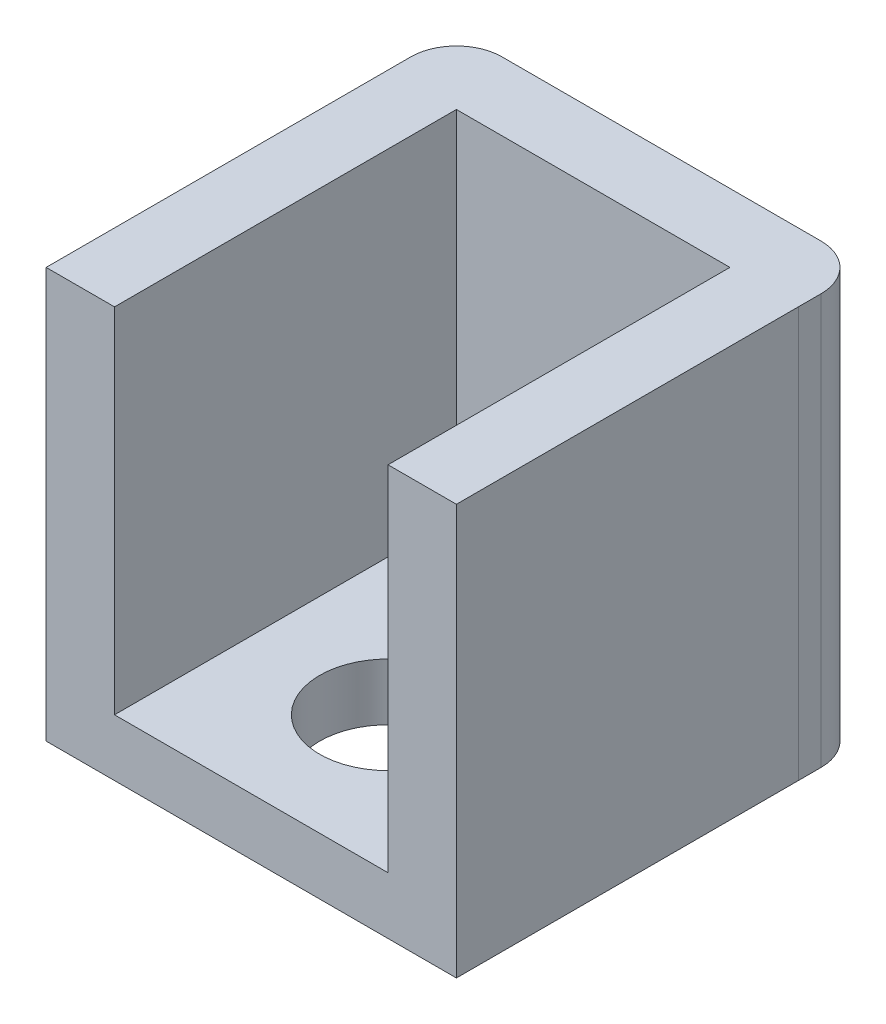
ISO-10303-21;
HEADER;
FILE_DESCRIPTION(('STEP AP214'),'2;1');
FILE_NAME('part.step','',(''),(''),'','','');
FILE_SCHEMA(('AUTOMOTIVE_DESIGN { 1 0 10303 214 1 1 1 1 }'));
ENDSEC;
DATA;
#1=APPLICATION_CONTEXT('core data for automotive mechanical design processes');
#2=APPLICATION_PROTOCOL_DEFINITION('international standard','automotive_design',2000,#1);
#3=PRODUCT_CONTEXT('',#1,'mechanical');
#4=PRODUCT('Part','Part','',(#3));
#5=PRODUCT_RELATED_PRODUCT_CATEGORY('part','',(#4));
#6=PRODUCT_DEFINITION_FORMATION('','',#4);
#7=PRODUCT_DEFINITION_CONTEXT('part definition',#1,'design');
#8=PRODUCT_DEFINITION('design','',#6,#7);
#9=PRODUCT_DEFINITION_SHAPE('','',#8);
#10=(LENGTH_UNIT() NAMED_UNIT(*) SI_UNIT(.MILLI.,.METRE.));
#11=(NAMED_UNIT(*) PLANE_ANGLE_UNIT() SI_UNIT($,.RADIAN.));
#12=(NAMED_UNIT(*) SI_UNIT($,.STERADIAN.) SOLID_ANGLE_UNIT());
#13=UNCERTAINTY_MEASURE_WITH_UNIT(LENGTH_MEASURE(1.E-05),#10,'distance_accuracy_value','');
#14=(GEOMETRIC_REPRESENTATION_CONTEXT(3) GLOBAL_UNCERTAINTY_ASSIGNED_CONTEXT((#13)) GLOBAL_UNIT_ASSIGNED_CONTEXT((#10,
#11,#12)) REPRESENTATION_CONTEXT('',''));
#15=CARTESIAN_POINT('',(0.,0.,0.));
#16=DIRECTION('',(0.,0.,1.));
#17=DIRECTION('',(1.,0.,0.));
#18=AXIS2_PLACEMENT_3D('',#15,#16,#17);
#19=CARTESIAN_POINT('',(0.,0.,3.));
#20=DIRECTION('',(0.,0.,-1.));
#21=DIRECTION('',(-1.,0.,0.));
#22=AXIS2_PLACEMENT_3D('',#19,#20,#21);
#23=PLANE('',#22);
#24=DIRECTION('',(-1.,0.,0.));
#25=VECTOR('',#24,1.);
#26=CARTESIAN_POINT('',(3.,2.5,3.));
#27=LINE('',#26,#25);
#28=CARTESIAN_POINT('',(14.9999140948555,2.5,3.));
#29=VERTEX_POINT('',#28);
#30=CARTESIAN_POINT('',(3.,2.5,3.));
#31=VERTEX_POINT('',#30);
#32=EDGE_CURVE('E139',#29,#31,#27,.T.);
#33=ORIENTED_EDGE('',*,*,#32,.F.);
#34=DIRECTION('',(0.,-1.,0.));
#35=VECTOR('',#34,1.);
#36=CARTESIAN_POINT('',(14.9999140948555,18.,3.));
#37=LINE('',#36,#35);
#38=CARTESIAN_POINT('',(14.9999140948555,18.,3.));
#39=VERTEX_POINT('',#38);
#40=EDGE_CURVE('E147',#39,#29,#37,.T.);
#41=ORIENTED_EDGE('',*,*,#40,.F.);
#42=DIRECTION('',(-1.,0.,0.));
#43=VECTOR('',#42,1.);
#44=CARTESIAN_POINT('',(0.,18.,3.));
#45=LINE('',#44,#43);
#46=CARTESIAN_POINT('',(3.,18.,3.));
#47=VERTEX_POINT('',#46);
#48=EDGE_CURVE('E194',#39,#47,#45,.T.);
#49=ORIENTED_EDGE('',*,*,#48,.T.);
#50=DIRECTION('',(0.,1.,0.));
#51=VECTOR('',#50,1.);
#52=CARTESIAN_POINT('',(3.,0.,3.));
#53=LINE('',#52,#51);
#54=EDGE_CURVE('E149',#31,#47,#53,.T.);
#55=ORIENTED_EDGE('',*,*,#54,.F.);
#56=EDGE_LOOP('',(#33,#41,#49,#55));
#57=FACE_BOUND('',#56,.T.);
#58=ADVANCED_FACE('F39',(#57),#23,.F.);
#59=CARTESIAN_POINT('',(14.9999140948555,18.,18.));
#60=DIRECTION('',(1.,0.,0.));
#61=DIRECTION('',(0.,1.,0.));
#62=AXIS2_PLACEMENT_3D('',#59,#60,#61);
#63=PLANE('',#62);
#64=DIRECTION('',(0.,0.,-1.));
#65=VECTOR('',#64,1.);
#66=CARTESIAN_POINT('',(14.9999140948555,2.5,18.));
#67=LINE('',#66,#65);
#68=CARTESIAN_POINT('',(14.9999140948555,2.5,18.));
#69=VERTEX_POINT('',#68);
#70=EDGE_CURVE('E131',#69,#29,#67,.T.);
#71=ORIENTED_EDGE('',*,*,#70,.F.);
#72=DIRECTION('',(0.,-1.,0.));
#73=VECTOR('',#72,1.);
#74=CARTESIAN_POINT('',(14.9999140948555,18.,18.));
#75=LINE('',#74,#73);
#76=CARTESIAN_POINT('',(14.9999140948555,18.,18.));
#77=VERTEX_POINT('',#76);
#78=EDGE_CURVE('E146',#77,#69,#75,.T.);
#79=ORIENTED_EDGE('',*,*,#78,.F.);
#80=DIRECTION('',(0.,0.,-1.));
#81=VECTOR('',#80,1.);
#82=CARTESIAN_POINT('',(14.9999140948555,18.,18.));
#83=LINE('',#82,#81);
#84=EDGE_CURVE('E173',#77,#39,#83,.T.);
#85=ORIENTED_EDGE('',*,*,#84,.T.);
#86=ORIENTED_EDGE('',*,*,#40,.T.);
#87=EDGE_LOOP('',(#71,#79,#85,#86));
#88=FACE_BOUND('',#87,.T.);
#89=ADVANCED_FACE('F144',(#88),#63,.F.);
#90=CARTESIAN_POINT('',(3.,0.,18.));
#91=DIRECTION('',(-1.,0.,0.));
#92=DIRECTION('',(0.,-1.,0.));
#93=AXIS2_PLACEMENT_3D('',#90,#91,#92);
#94=PLANE('',#93);
#95=DIRECTION('',(0.,0.,-1.));
#96=VECTOR('',#95,1.);
#97=CARTESIAN_POINT('',(3.,2.5,18.));
#98=LINE('',#97,#96);
#99=CARTESIAN_POINT('',(3.,2.5,18.));
#100=VERTEX_POINT('',#99);
#101=EDGE_CURVE('E134',#100,#31,#98,.T.);
#102=ORIENTED_EDGE('',*,*,#101,.T.);
#103=ORIENTED_EDGE('',*,*,#54,.T.);
#104=DIRECTION('',(0.,0.,-1.));
#105=VECTOR('',#104,1.);
#106=CARTESIAN_POINT('',(3.,18.,18.));
#107=LINE('',#106,#105);
#108=CARTESIAN_POINT('',(3.,18.,18.));
#109=VERTEX_POINT('',#108);
#110=EDGE_CURVE('E166',#109,#47,#107,.T.);
#111=ORIENTED_EDGE('',*,*,#110,.F.);
#112=DIRECTION('',(0.,1.,0.));
#113=VECTOR('',#112,1.);
#114=CARTESIAN_POINT('',(3.,0.,18.));
#115=LINE('',#114,#113);
#116=EDGE_CURVE('E252',#100,#109,#115,.T.);
#117=ORIENTED_EDGE('',*,*,#116,.F.);
#118=EDGE_LOOP('',(#102,#103,#111,#117));
#119=FACE_BOUND('',#118,.T.);
#120=ADVANCED_FACE('F292',(#119),#94,.F.);
#121=DIRECTION('',(0.,1.,0.));
#122=VECTOR('',#121,1.);
#123=CARTESIAN_POINT('',(17.9999140948555,18.,3.));
#124=LINE('',#123,#122);
#125=CARTESIAN_POINT('',(17.9999140948555,0.,3.));
#126=VERTEX_POINT('',#125);
#127=CARTESIAN_POINT('',(17.9999140948555,18.,3.));
#128=VERTEX_POINT('',#127);
#129=EDGE_CURVE('E157',#126,#128,#124,.T.);
#130=ORIENTED_EDGE('',*,*,#129,.F.);
#131=DIRECTION('',(1.,0.,0.));
#132=VECTOR('',#131,1.);
#133=CARTESIAN_POINT('',(0.,0.,3.));
#134=LINE('',#133,#132);
#135=CARTESIAN_POINT('',(18.,0.,3.));
#136=VERTEX_POINT('',#135);
#137=EDGE_CURVE('E187',#126,#136,#134,.T.);
#138=ORIENTED_EDGE('',*,*,#137,.T.);
#139=DIRECTION('',(0.,1.,0.));
#140=VECTOR('',#139,1.);
#141=CARTESIAN_POINT('',(18.,0.,3.));
#142=LINE('',#141,#140);
#143=CARTESIAN_POINT('',(18.,18.,3.));
#144=VERTEX_POINT('',#143);
#145=EDGE_CURVE('E190',#136,#144,#142,.T.);
#146=ORIENTED_EDGE('',*,*,#145,.T.);
#147=EDGE_CURVE('E195',#144,#128,#45,.T.);
#148=ORIENTED_EDGE('',*,*,#147,.T.);
#149=EDGE_LOOP('',(#130,#138,#146,#148));
#150=FACE_BOUND('',#149,.T.);
#151=ADVANCED_FACE('F288',(#150),#23,.F.);
#152=CARTESIAN_POINT('',(0.,0.,3.));
#153=DIRECTION('',(1.,0.,0.));
#154=DIRECTION('',(0.,1.,0.));
#155=AXIS2_PLACEMENT_3D('',#152,#153,#154);
#156=PLANE('',#155);
#157=DIRECTION('',(0.,0.,-1.));
#158=VECTOR('',#157,1.);
#159=CARTESIAN_POINT('',(0.,18.,3.));
#160=LINE('',#159,#158);
#161=CARTESIAN_POINT('',(0.,18.,18.));
#162=VERTEX_POINT('',#161);
#163=CARTESIAN_POINT('',(0.,18.,2.));
#164=VERTEX_POINT('',#163);
#165=EDGE_CURVE('E198',#162,#164,#160,.T.);
#166=ORIENTED_EDGE('',*,*,#165,.T.);
#167=DIRECTION('',(0.,-1.,0.));
#168=VECTOR('',#167,1.);
#169=CARTESIAN_POINT('',(0.,0.,2.));
#170=LINE('',#169,#168);
#171=CARTESIAN_POINT('',(0.,0.,2.));
#172=VERTEX_POINT('',#171);
#173=EDGE_CURVE('E217',#164,#172,#170,.T.);
#174=ORIENTED_EDGE('',*,*,#173,.T.);
#175=DIRECTION('',(0.,0.,-1.));
#176=VECTOR('',#175,1.);
#177=CARTESIAN_POINT('',(0.,0.,3.));
#178=LINE('',#177,#176);
#179=CARTESIAN_POINT('',(0.,0.,18.));
#180=VERTEX_POINT('',#179);
#181=EDGE_CURVE('E213',#180,#172,#178,.T.);
#182=ORIENTED_EDGE('',*,*,#181,.F.);
#183=DIRECTION('',(0.,-1.,0.));
#184=VECTOR('',#183,1.);
#185=CARTESIAN_POINT('',(0.,0.,18.));
#186=LINE('',#185,#184);
#187=EDGE_CURVE('E257',#162,#180,#186,.T.);
#188=ORIENTED_EDGE('',*,*,#187,.F.);
#189=EDGE_LOOP('',(#166,#174,#182,#188));
#190=FACE_BOUND('',#189,.T.);
#191=ADVANCED_FACE('F296',(#190),#156,.F.);
#192=CARTESIAN_POINT('',(0.,0.,3.));
#193=DIRECTION('',(0.,1.,0.));
#194=DIRECTION('',(0.,0.,1.));
#195=AXIS2_PLACEMENT_3D('',#192,#193,#194);
#196=PLANE('',#195);
#197=CARTESIAN_POINT('',(8.99995704742773,0.,12.));
#198=DIRECTION('',(0.,-1.,0.));
#199=DIRECTION('',(0.,0.,-1.));
#200=AXIS2_PLACEMENT_3D('',#197,#198,#199);
#201=CIRCLE('',#200,3.);
#202=CARTESIAN_POINT('',(8.99995704742773,0.,9.));
#203=VERTEX_POINT('',#202);
#204=EDGE_CURVE('E267',#203,#203,#201,.T.);
#205=ORIENTED_EDGE('',*,*,#204,.F.);
#206=EDGE_LOOP('',(#205));
#207=FACE_BOUND('',#206,.T.);
#208=DIRECTION('',(1.,0.,0.));
#209=VECTOR('',#208,1.);
#210=CARTESIAN_POINT('',(0.,0.,0.));
#211=LINE('',#210,#209);
#212=CARTESIAN_POINT('',(2.,0.,0.));
#213=VERTEX_POINT('',#212);
#214=CARTESIAN_POINT('',(16.,0.,0.));
#215=VERTEX_POINT('',#214);
#216=EDGE_CURVE('E186',#213,#215,#211,.T.);
#217=ORIENTED_EDGE('',*,*,#216,.T.);
#218=CARTESIAN_POINT('',(16.,0.,2.));
#219=DIRECTION('',(0.,1.,0.));
#220=DIRECTION('',(0.,0.,1.));
#221=AXIS2_PLACEMENT_3D('',#218,#219,#220);
#222=CIRCLE('',#221,2.);
#223=CARTESIAN_POINT('',(18.,0.,2.));
#224=VERTEX_POINT('',#223);
#225=EDGE_CURVE('E11',#215,#224,#222,.F.);
#226=ORIENTED_EDGE('',*,*,#225,.T.);
#227=DIRECTION('',(0.,0.,-1.));
#228=VECTOR('',#227,1.);
#229=CARTESIAN_POINT('',(18.,0.,3.));
#230=LINE('',#229,#228);
#231=EDGE_CURVE('E209',#136,#224,#230,.T.);
#232=ORIENTED_EDGE('',*,*,#231,.F.);
#233=ORIENTED_EDGE('',*,*,#137,.F.);
#234=DIRECTION('',(0.,0.,-1.));
#235=VECTOR('',#234,1.);
#236=CARTESIAN_POINT('',(17.9999140948555,0.,18.));
#237=LINE('',#236,#235);
#238=CARTESIAN_POINT('',(17.9999140948555,0.,18.));
#239=VERTEX_POINT('',#238);
#240=EDGE_CURVE('E182',#239,#126,#237,.T.);
#241=ORIENTED_EDGE('',*,*,#240,.F.);
#242=DIRECTION('',(1.,0.,0.));
#243=VECTOR('',#242,1.);
#244=CARTESIAN_POINT('',(14.9999140948555,0.,18.));
#245=LINE('',#244,#243);
#246=EDGE_CURVE('E156',#180,#239,#245,.T.);
#247=ORIENTED_EDGE('',*,*,#246,.F.);
#248=ORIENTED_EDGE('',*,*,#181,.T.);
#249=CARTESIAN_POINT('',(2.,0.,2.));
#250=DIRECTION('',(0.,1.,0.));
#251=DIRECTION('',(0.,0.,1.));
#252=AXIS2_PLACEMENT_3D('',#249,#250,#251);
#253=CIRCLE('',#252,2.);
#254=EDGE_CURVE('E221',#172,#213,#253,.F.);
#255=ORIENTED_EDGE('',*,*,#254,.T.);
#256=EDGE_LOOP('',(#217,#226,#232,#233,#241,#247,#248,#255));
#257=FACE_BOUND('',#256,.T.);
#258=ADVANCED_FACE('F302',(#207,#257),#196,.F.);
#259=CARTESIAN_POINT('',(18.,0.,3.));
#260=DIRECTION('',(-1.,0.,0.));
#261=DIRECTION('',(0.,-1.,0.));
#262=AXIS2_PLACEMENT_3D('',#259,#260,#261);
#263=PLANE('',#262);
#264=ORIENTED_EDGE('',*,*,#231,.T.);
#265=DIRECTION('',(0.,1.,0.));
#266=VECTOR('',#265,1.);
#267=CARTESIAN_POINT('',(18.,18.,2.));
#268=LINE('',#267,#266);
#269=CARTESIAN_POINT('',(18.,18.,2.));
#270=VERTEX_POINT('',#269);
#271=EDGE_CURVE('E231',#224,#270,#268,.T.);
#272=ORIENTED_EDGE('',*,*,#271,.T.);
#273=DIRECTION('',(0.,0.,-1.));
#274=VECTOR('',#273,1.);
#275=CARTESIAN_POINT('',(18.,18.,3.));
#276=LINE('',#275,#274);
#277=EDGE_CURVE('E206',#144,#270,#276,.T.);
#278=ORIENTED_EDGE('',*,*,#277,.F.);
#279=ORIENTED_EDGE('',*,*,#145,.F.);
#280=EDGE_LOOP('',(#264,#272,#278,#279));
#281=FACE_BOUND('',#280,.T.);
#282=ADVANCED_FACE('F325',(#281),#263,.F.);
#283=CARTESIAN_POINT('',(0.,18.,3.));
#284=DIRECTION('',(0.,-1.,0.));
#285=DIRECTION('',(0.,0.,-1.));
#286=AXIS2_PLACEMENT_3D('',#283,#284,#285);
#287=PLANE('',#286);
#288=ORIENTED_EDGE('',*,*,#277,.T.);
#289=CARTESIAN_POINT('',(16.,18.,2.));
#290=DIRECTION('',(0.,-1.,0.));
#291=DIRECTION('',(0.,0.,-1.));
#292=AXIS2_PLACEMENT_3D('',#289,#290,#291);
#293=CIRCLE('',#292,2.);
#294=CARTESIAN_POINT('',(16.,18.,0.));
#295=VERTEX_POINT('',#294);
#296=EDGE_CURVE('E63',#270,#295,#293,.F.);
#297=ORIENTED_EDGE('',*,*,#296,.T.);
#298=DIRECTION('',(-1.,0.,0.));
#299=VECTOR('',#298,1.);
#300=CARTESIAN_POINT('',(0.,18.,0.));
#301=LINE('',#300,#299);
#302=CARTESIAN_POINT('',(2.,18.,0.));
#303=VERTEX_POINT('',#302);
#304=EDGE_CURVE('E191',#295,#303,#301,.T.);
#305=ORIENTED_EDGE('',*,*,#304,.T.);
#306=CARTESIAN_POINT('',(2.,18.,2.));
#307=DIRECTION('',(0.,-1.,0.));
#308=DIRECTION('',(0.,0.,-1.));
#309=AXIS2_PLACEMENT_3D('',#306,#307,#308);
#310=CIRCLE('',#309,2.);
#311=EDGE_CURVE('E228',#303,#164,#310,.F.);
#312=ORIENTED_EDGE('',*,*,#311,.T.);
#313=ORIENTED_EDGE('',*,*,#165,.F.);
#314=DIRECTION('',(-1.,0.,0.));
#315=VECTOR('',#314,1.);
#316=CARTESIAN_POINT('',(0.,18.,18.));
#317=LINE('',#316,#315);
#318=EDGE_CURVE('E248',#109,#162,#317,.T.);
#319=ORIENTED_EDGE('',*,*,#318,.F.);
#320=ORIENTED_EDGE('',*,*,#110,.T.);
#321=ORIENTED_EDGE('',*,*,#48,.F.);
#322=ORIENTED_EDGE('',*,*,#84,.F.);
#323=DIRECTION('',(-1.,0.,0.));
#324=VECTOR('',#323,1.);
#325=CARTESIAN_POINT('',(14.9999140948555,18.,18.));
#326=LINE('',#325,#324);
#327=CARTESIAN_POINT('',(17.9999140948555,18.,18.));
#328=VERTEX_POINT('',#327);
#329=EDGE_CURVE('E153',#328,#77,#326,.T.);
#330=ORIENTED_EDGE('',*,*,#329,.F.);
#331=DIRECTION('',(0.,0.,-1.));
#332=VECTOR('',#331,1.);
#333=CARTESIAN_POINT('',(17.9999140948555,18.,18.));
#334=LINE('',#333,#332);
#335=EDGE_CURVE('E178',#328,#128,#334,.T.);
#336=ORIENTED_EDGE('',*,*,#335,.T.);
#337=ORIENTED_EDGE('',*,*,#147,.F.);
#338=EDGE_LOOP('',(#288,#297,#305,#312,#313,#319,#320,#321,#322,#330,#336,#337));
#339=FACE_BOUND('',#338,.T.);
#340=ADVANCED_FACE('F246',(#339),#287,.F.);
#341=CARTESIAN_POINT('',(0.,0.,0.));
#342=DIRECTION('',(0.,0.,-1.));
#343=DIRECTION('',(-1.,0.,0.));
#344=AXIS2_PLACEMENT_3D('',#341,#342,#343);
#345=PLANE('',#344);
#346=ORIENTED_EDGE('',*,*,#304,.F.);
#347=DIRECTION('',(0.,1.,0.));
#348=VECTOR('',#347,1.);
#349=CARTESIAN_POINT('',(16.,0.,0.));
#350=LINE('',#349,#348);
#351=EDGE_CURVE('E49',#295,#215,#350,.F.);
#352=ORIENTED_EDGE('',*,*,#351,.T.);
#353=ORIENTED_EDGE('',*,*,#216,.F.);
#354=DIRECTION('',(0.,-1.,0.));
#355=VECTOR('',#354,1.);
#356=CARTESIAN_POINT('',(2.,18.,0.));
#357=LINE('',#356,#355);
#358=EDGE_CURVE('E224',#213,#303,#357,.F.);
#359=ORIENTED_EDGE('',*,*,#358,.T.);
#360=EDGE_LOOP('',(#346,#352,#353,#359));
#361=FACE_BOUND('',#360,.T.);
#362=ADVANCED_FACE('F322',(#361),#345,.T.);
#363=CARTESIAN_POINT('',(17.9999140948555,18.,18.));
#364=DIRECTION('',(-1.,0.,0.));
#365=DIRECTION('',(0.,-1.,0.));
#366=AXIS2_PLACEMENT_3D('',#363,#364,#365);
#367=PLANE('',#366);
#368=ORIENTED_EDGE('',*,*,#129,.T.);
#369=ORIENTED_EDGE('',*,*,#335,.F.);
#370=DIRECTION('',(0.,1.,0.));
#371=VECTOR('',#370,1.);
#372=CARTESIAN_POINT('',(17.9999140948555,18.,18.));
#373=LINE('',#372,#371);
#374=EDGE_CURVE('E161',#239,#328,#373,.T.);
#375=ORIENTED_EDGE('',*,*,#374,.F.);
#376=ORIENTED_EDGE('',*,*,#240,.T.);
#377=EDGE_LOOP('',(#368,#369,#375,#376));
#378=FACE_BOUND('',#377,.T.);
#379=ADVANCED_FACE('F315',(#378),#367,.F.);
#380=CARTESIAN_POINT('',(0.,0.,18.));
#381=DIRECTION('',(0.,0.,1.));
#382=DIRECTION('',(1.,0.,0.));
#383=AXIS2_PLACEMENT_3D('',#380,#381,#382);
#384=PLANE('',#383);
#385=ORIENTED_EDGE('',*,*,#78,.T.);
#386=DIRECTION('',(-1.,0.,0.));
#387=VECTOR('',#386,1.);
#388=CARTESIAN_POINT('',(3.,2.5,18.));
#389=LINE('',#388,#387);
#390=EDGE_CURVE('E128',#69,#100,#389,.T.);
#391=ORIENTED_EDGE('',*,*,#390,.T.);
#392=ORIENTED_EDGE('',*,*,#116,.T.);
#393=ORIENTED_EDGE('',*,*,#318,.T.);
#394=ORIENTED_EDGE('',*,*,#187,.T.);
#395=ORIENTED_EDGE('',*,*,#246,.T.);
#396=ORIENTED_EDGE('',*,*,#374,.T.);
#397=ORIENTED_EDGE('',*,*,#329,.T.);
#398=EDGE_LOOP('',(#385,#391,#392,#393,#394,#395,#396,#397));
#399=FACE_BOUND('',#398,.T.);
#400=ADVANCED_FACE('F151',(#399),#384,.T.);
#401=CARTESIAN_POINT('',(3.,2.5,18.));
#402=DIRECTION('',(0.,-1.,0.));
#403=DIRECTION('',(0.,0.,-1.));
#404=AXIS2_PLACEMENT_3D('',#401,#402,#403);
#405=PLANE('',#404);
#406=CARTESIAN_POINT('',(8.99995704742773,2.5,12.));
#407=DIRECTION('',(0.,-1.,0.));
#408=DIRECTION('',(0.,0.,-1.));
#409=AXIS2_PLACEMENT_3D('',#406,#407,#408);
#410=CIRCLE('',#409,3.);
#411=CARTESIAN_POINT('',(8.99995704742773,2.5,9.));
#412=VERTEX_POINT('',#411);
#413=EDGE_CURVE('E43',#412,#412,#410,.T.);
#414=ORIENTED_EDGE('',*,*,#413,.T.);
#415=EDGE_LOOP('',(#414));
#416=FACE_BOUND('',#415,.T.);
#417=ORIENTED_EDGE('',*,*,#32,.T.);
#418=ORIENTED_EDGE('',*,*,#101,.F.);
#419=ORIENTED_EDGE('',*,*,#390,.F.);
#420=ORIENTED_EDGE('',*,*,#70,.T.);
#421=EDGE_LOOP('',(#417,#418,#419,#420));
#422=FACE_BOUND('',#421,.T.);
#423=ADVANCED_FACE('F130',(#416,#422),#405,.F.);
#424=CARTESIAN_POINT('',(2.,0.,2.));
#425=DIRECTION('',(0.,1.,0.));
#426=DIRECTION('',(-1.,0.,0.));
#427=AXIS2_PLACEMENT_3D('',#424,#425,#426);
#428=CYLINDRICAL_SURFACE('',#427,2.);
#429=ORIENTED_EDGE('',*,*,#311,.F.);
#430=ORIENTED_EDGE('',*,*,#358,.F.);
#431=ORIENTED_EDGE('',*,*,#254,.F.);
#432=ORIENTED_EDGE('',*,*,#173,.F.);
#433=EDGE_LOOP('',(#429,#430,#431,#432));
#434=FACE_BOUND('',#433,.T.);
#435=ADVANCED_FACE('F283',(#434),#428,.T.);
#436=CARTESIAN_POINT('',(16.,0.,2.));
#437=DIRECTION('',(0.,-1.,0.));
#438=DIRECTION('',(1.,0.,0.));
#439=AXIS2_PLACEMENT_3D('',#436,#437,#438);
#440=CYLINDRICAL_SURFACE('',#439,2.);
#441=ORIENTED_EDGE('',*,*,#225,.F.);
#442=ORIENTED_EDGE('',*,*,#351,.F.);
#443=ORIENTED_EDGE('',*,*,#296,.F.);
#444=ORIENTED_EDGE('',*,*,#271,.F.);
#445=EDGE_LOOP('',(#441,#442,#443,#444));
#446=FACE_BOUND('',#445,.T.);
#447=ADVANCED_FACE('F41',(#446),#440,.T.);
#448=CARTESIAN_POINT('',(8.99995704742773,18.,12.));
#449=DIRECTION('',(0.,-1.,0.));
#450=DIRECTION('',(0.,0.,-1.));
#451=AXIS2_PLACEMENT_3D('',#448,#449,#450);
#452=CYLINDRICAL_SURFACE('',#451,3.);
#453=ORIENTED_EDGE('',*,*,#204,.T.);
#454=EDGE_LOOP('',(#453));
#455=FACE_BOUND('',#454,.T.);
#456=ORIENTED_EDGE('',*,*,#413,.F.);
#457=EDGE_LOOP('',(#456));
#458=FACE_BOUND('',#457,.T.);
#459=ADVANCED_FACE('F277',(#455,#458),#452,.F.);
#460=CLOSED_SHELL('',(#58,#89,#120,#151,#191,#258,#282,#340,#362,#379,#400,#423,#435,#447,#459));
#461=MANIFOLD_SOLID_BREP('B2',#460);
#462=ADVANCED_BREP_SHAPE_REPRESENTATION('',(#18,#461),#14);
#463=SHAPE_DEFINITION_REPRESENTATION(#9,#462);
ENDSEC;
END-ISO-10303-21;
